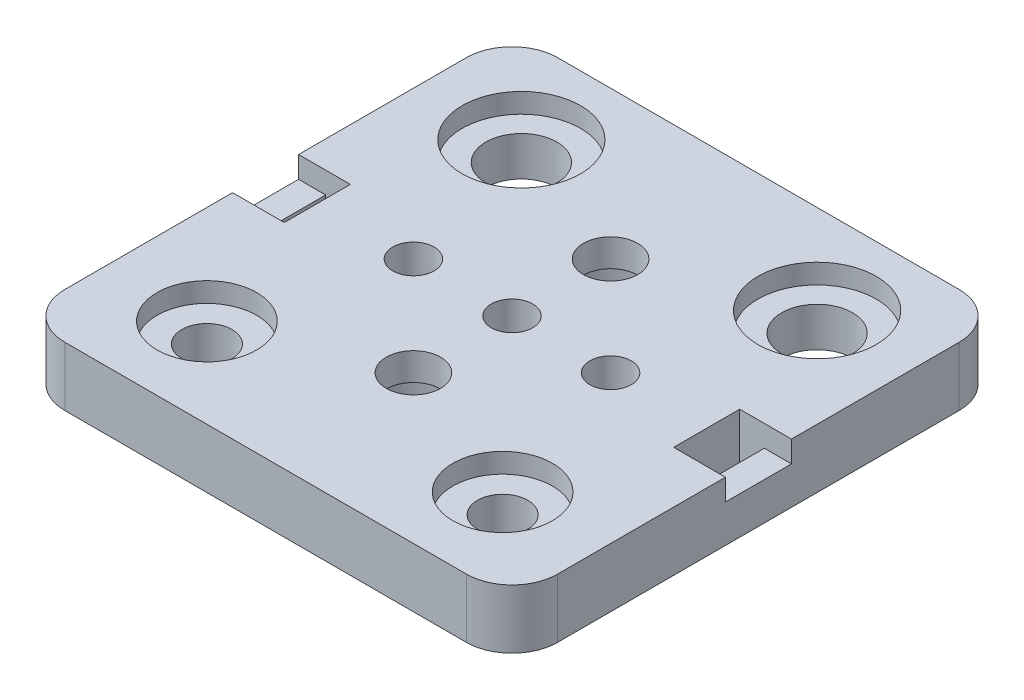
ISO-10303-21;
HEADER;
FILE_DESCRIPTION(('STEP AP214'),'2;1');
FILE_NAME('part.step','',(''),(''),'','','');
FILE_SCHEMA(('AUTOMOTIVE_DESIGN { 1 0 10303 214 1 1 1 1 }'));
ENDSEC;
DATA;
#1=APPLICATION_CONTEXT('core data for automotive mechanical design processes');
#2=APPLICATION_PROTOCOL_DEFINITION('international standard','automotive_design',2000,#1);
#3=PRODUCT_CONTEXT('',#1,'mechanical');
#4=PRODUCT('Part','Part','',(#3));
#5=PRODUCT_RELATED_PRODUCT_CATEGORY('part','',(#4));
#6=PRODUCT_DEFINITION_FORMATION('','',#4);
#7=PRODUCT_DEFINITION_CONTEXT('part definition',#1,'design');
#8=PRODUCT_DEFINITION('design','',#6,#7);
#9=PRODUCT_DEFINITION_SHAPE('','',#8);
#10=(LENGTH_UNIT() NAMED_UNIT(*) SI_UNIT(.MILLI.,.METRE.));
#11=(NAMED_UNIT(*) PLANE_ANGLE_UNIT() SI_UNIT($,.RADIAN.));
#12=(NAMED_UNIT(*) SI_UNIT($,.STERADIAN.) SOLID_ANGLE_UNIT());
#13=UNCERTAINTY_MEASURE_WITH_UNIT(LENGTH_MEASURE(1.E-05),#10,'distance_accuracy_value','');
#14=(GEOMETRIC_REPRESENTATION_CONTEXT(3) GLOBAL_UNCERTAINTY_ASSIGNED_CONTEXT((#13)) GLOBAL_UNIT_ASSIGNED_CONTEXT((#10,
#11,#12)) REPRESENTATION_CONTEXT('',''));
#15=CARTESIAN_POINT('',(0.,0.,0.));
#16=DIRECTION('',(0.,0.,1.));
#17=DIRECTION('',(1.,0.,0.));
#18=AXIS2_PLACEMENT_3D('',#15,#16,#17);
#19=CARTESIAN_POINT('',(-15.,6.,15.95));
#20=DIRECTION('',(0.,-1.,0.));
#21=DIRECTION('',(0.,0.,-1.));
#22=AXIS2_PLACEMENT_3D('',#19,#20,#21);
#23=CYLINDRICAL_SURFACE('',#22,2.55);
#24=CARTESIAN_POINT('',(-15.,0.,15.95));
#25=DIRECTION('',(0.,1.,0.));
#26=DIRECTION('',(0.,0.,-1.));
#27=AXIS2_PLACEMENT_3D('',#24,#25,#26);
#28=CIRCLE('',#27,2.55);
#29=CARTESIAN_POINT('',(-15.,0.,13.4));
#30=VERTEX_POINT('',#29);
#31=EDGE_CURVE('E328',#30,#30,#28,.T.);
#32=ORIENTED_EDGE('',*,*,#31,.F.);
#33=EDGE_LOOP('',(#32));
#34=FACE_BOUND('',#33,.T.);
#35=CARTESIAN_POINT('',(-15.,4.,15.95));
#36=DIRECTION('',(0.,1.,0.));
#37=DIRECTION('',(0.,0.,1.));
#38=AXIS2_PLACEMENT_3D('',#35,#36,#37);
#39=CIRCLE('',#38,2.55);
#40=CARTESIAN_POINT('',(-15.,4.,18.5));
#41=VERTEX_POINT('',#40);
#42=EDGE_CURVE('E52',#41,#41,#39,.T.);
#43=ORIENTED_EDGE('',*,*,#42,.T.);
#44=EDGE_LOOP('',(#43));
#45=FACE_BOUND('',#44,.T.);
#46=ADVANCED_FACE('F48',(#34,#45),#23,.F.);
#47=CARTESIAN_POINT('',(15.,6.,15.95));
#48=DIRECTION('',(0.,-1.,0.));
#49=DIRECTION('',(0.,0.,-1.));
#50=AXIS2_PLACEMENT_3D('',#47,#48,#49);
#51=CYLINDRICAL_SURFACE('',#50,2.55);
#52=CARTESIAN_POINT('',(15.,0.,15.95));
#53=DIRECTION('',(0.,1.,0.));
#54=DIRECTION('',(0.,0.,1.));
#55=AXIS2_PLACEMENT_3D('',#52,#53,#54);
#56=CIRCLE('',#55,2.55);
#57=CARTESIAN_POINT('',(15.,0.,18.5));
#58=VERTEX_POINT('',#57);
#59=EDGE_CURVE('E331',#58,#58,#56,.T.);
#60=ORIENTED_EDGE('',*,*,#59,.F.);
#61=EDGE_LOOP('',(#60));
#62=FACE_BOUND('',#61,.T.);
#63=CARTESIAN_POINT('',(15.,4.,15.95));
#64=DIRECTION('',(0.,1.,0.));
#65=DIRECTION('',(0.,0.,1.));
#66=AXIS2_PLACEMENT_3D('',#63,#64,#65);
#67=CIRCLE('',#66,2.55);
#68=CARTESIAN_POINT('',(15.,4.,18.5));
#69=VERTEX_POINT('',#68);
#70=EDGE_CURVE('E292',#69,#69,#67,.T.);
#71=ORIENTED_EDGE('',*,*,#70,.T.);
#72=EDGE_LOOP('',(#71));
#73=FACE_BOUND('',#72,.T.);
#74=ADVANCED_FACE('F404',(#62,#73),#51,.F.);
#75=CARTESIAN_POINT('',(15.,6.,-15.95));
#76=DIRECTION('',(0.,-1.,0.));
#77=DIRECTION('',(0.,0.,-1.));
#78=AXIS2_PLACEMENT_3D('',#75,#76,#77);
#79=CYLINDRICAL_SURFACE('',#78,3.6);
#80=CARTESIAN_POINT('',(15.,0.,-15.95));
#81=DIRECTION('',(0.,1.,0.));
#82=DIRECTION('',(0.,0.,-1.));
#83=AXIS2_PLACEMENT_3D('',#80,#81,#82);
#84=CIRCLE('',#83,3.6);
#85=CARTESIAN_POINT('',(15.,0.,-19.55));
#86=VERTEX_POINT('',#85);
#87=EDGE_CURVE('E334',#86,#86,#84,.T.);
#88=ORIENTED_EDGE('',*,*,#87,.F.);
#89=EDGE_LOOP('',(#88));
#90=FACE_BOUND('',#89,.T.);
#91=CARTESIAN_POINT('',(15.,4.,-15.95));
#92=DIRECTION('',(0.,1.,0.));
#93=DIRECTION('',(0.,0.,1.));
#94=AXIS2_PLACEMENT_3D('',#91,#92,#93);
#95=CIRCLE('',#94,3.6);
#96=CARTESIAN_POINT('',(15.,4.,-12.35));
#97=VERTEX_POINT('',#96);
#98=EDGE_CURVE('E299',#97,#97,#95,.T.);
#99=ORIENTED_EDGE('',*,*,#98,.T.);
#100=EDGE_LOOP('',(#99));
#101=FACE_BOUND('',#100,.T.);
#102=ADVANCED_FACE('F459',(#90,#101),#79,.F.);
#103=CARTESIAN_POINT('',(-15.,6.,-15.95));
#104=DIRECTION('',(0.,-1.,0.));
#105=DIRECTION('',(0.,0.,-1.));
#106=AXIS2_PLACEMENT_3D('',#103,#104,#105);
#107=CYLINDRICAL_SURFACE('',#106,3.6);
#108=CARTESIAN_POINT('',(-15.,0.,-15.95));
#109=DIRECTION('',(0.,1.,0.));
#110=DIRECTION('',(0.,0.,1.));
#111=AXIS2_PLACEMENT_3D('',#108,#109,#110);
#112=CIRCLE('',#111,3.6);
#113=CARTESIAN_POINT('',(-15.,0.,-12.35));
#114=VERTEX_POINT('',#113);
#115=EDGE_CURVE('E337',#114,#114,#112,.T.);
#116=ORIENTED_EDGE('',*,*,#115,.F.);
#117=EDGE_LOOP('',(#116));
#118=FACE_BOUND('',#117,.T.);
#119=CARTESIAN_POINT('',(-15.,4.,-15.95));
#120=DIRECTION('',(0.,1.,0.));
#121=DIRECTION('',(0.,0.,1.));
#122=AXIS2_PLACEMENT_3D('',#119,#120,#121);
#123=CIRCLE('',#122,3.6);
#124=CARTESIAN_POINT('',(-15.,4.,-12.35));
#125=VERTEX_POINT('',#124);
#126=EDGE_CURVE('E306',#125,#125,#123,.T.);
#127=ORIENTED_EDGE('',*,*,#126,.T.);
#128=EDGE_LOOP('',(#127));
#129=FACE_BOUND('',#128,.T.);
#130=ADVANCED_FACE('F423',(#118,#129),#107,.F.);
#131=CARTESIAN_POINT('',(-20.365,6.,-20.365));
#132=DIRECTION('',(0.,1.,0.));
#133=DIRECTION('',(0.,0.,1.));
#134=AXIS2_PLACEMENT_3D('',#131,#132,#133);
#135=PLANE('',#134);
#136=CARTESIAN_POINT('',(0.,6.,-10.));
#137=DIRECTION('',(0.,-1.,0.));
#138=DIRECTION('',(0.,0.,-1.));
#139=AXIS2_PLACEMENT_3D('',#136,#137,#138);
#140=CIRCLE('',#139,2.75);
#141=CARTESIAN_POINT('',(0.,6.,-12.75));
#142=VERTEX_POINT('',#141);
#143=EDGE_CURVE('E801',#142,#142,#140,.T.);
#144=ORIENTED_EDGE('',*,*,#143,.T.);
#145=EDGE_LOOP('',(#144));
#146=FACE_BOUND('',#145,.T.);
#147=CARTESIAN_POINT('',(0.,6.,10.));
#148=DIRECTION('',(0.,-1.,0.));
#149=DIRECTION('',(0.,0.,-1.));
#150=AXIS2_PLACEMENT_3D('',#147,#148,#149);
#151=CIRCLE('',#150,2.75);
#152=CARTESIAN_POINT('',(0.,6.,7.25));
#153=VERTEX_POINT('',#152);
#154=EDGE_CURVE('E212',#153,#153,#151,.T.);
#155=ORIENTED_EDGE('',*,*,#154,.T.);
#156=EDGE_LOOP('',(#155));
#157=FACE_BOUND('',#156,.T.);
#158=DIRECTION('',(-1.,0.,0.));
#159=VECTOR('',#158,1.);
#160=CARTESIAN_POINT('',(25.,6.,-3.35));
#161=LINE('',#160,#159);
#162=CARTESIAN_POINT('',(25.,6.,-3.35));
#163=VERTEX_POINT('',#162);
#164=CARTESIAN_POINT('',(19.75,6.,-3.35));
#165=VERTEX_POINT('',#164);
#166=EDGE_CURVE('E194',#163,#165,#161,.T.);
#167=ORIENTED_EDGE('',*,*,#166,.F.);
#168=DIRECTION('',(0.,0.,-1.));
#169=VECTOR('',#168,1.);
#170=CARTESIAN_POINT('',(25.,6.,20.365));
#171=LINE('',#170,#169);
#172=CARTESIAN_POINT('',(25.,6.,-20.365));
#173=VERTEX_POINT('',#172);
#174=EDGE_CURVE('E355',#163,#173,#171,.T.);
#175=ORIENTED_EDGE('',*,*,#174,.T.);
#176=CARTESIAN_POINT('',(20.365,6.,-20.365));
#177=DIRECTION('',(0.,1.,0.));
#178=DIRECTION('',(0.,0.,1.));
#179=AXIS2_PLACEMENT_3D('',#176,#177,#178);
#180=CIRCLE('',#179,4.635);
#181=CARTESIAN_POINT('',(20.365,6.,-25.));
#182=VERTEX_POINT('',#181);
#183=EDGE_CURVE('E359',#173,#182,#180,.T.);
#184=ORIENTED_EDGE('',*,*,#183,.T.);
#185=DIRECTION('',(-1.,0.,0.));
#186=VECTOR('',#185,1.);
#187=CARTESIAN_POINT('',(20.365,6.,-25.));
#188=LINE('',#187,#186);
#189=CARTESIAN_POINT('',(-20.365,6.,-25.));
#190=VERTEX_POINT('',#189);
#191=EDGE_CURVE('E361',#182,#190,#188,.T.);
#192=ORIENTED_EDGE('',*,*,#191,.T.);
#193=CARTESIAN_POINT('',(-20.365,6.,-20.365));
#194=DIRECTION('',(0.,1.,0.));
#195=DIRECTION('',(0.,0.,1.));
#196=AXIS2_PLACEMENT_3D('',#193,#194,#195);
#197=CIRCLE('',#196,4.635);
#198=CARTESIAN_POINT('',(-25.,6.,-20.365));
#199=VERTEX_POINT('',#198);
#200=EDGE_CURVE('E341',#190,#199,#197,.T.);
#201=ORIENTED_EDGE('',*,*,#200,.T.);
#202=DIRECTION('',(0.,0.,1.));
#203=VECTOR('',#202,1.);
#204=CARTESIAN_POINT('',(-25.,6.,20.365));
#205=LINE('',#204,#203);
#206=CARTESIAN_POINT('',(-25.,6.,-3.35));
#207=VERTEX_POINT('',#206);
#208=EDGE_CURVE('E346',#199,#207,#205,.T.);
#209=ORIENTED_EDGE('',*,*,#208,.T.);
#210=DIRECTION('',(-1.,0.,0.));
#211=VECTOR('',#210,1.);
#212=CARTESIAN_POINT('',(-25.,6.,-3.35));
#213=LINE('',#212,#211);
#214=CARTESIAN_POINT('',(-19.75,6.,-3.35));
#215=VERTEX_POINT('',#214);
#216=EDGE_CURVE('E263',#215,#207,#213,.T.);
#217=ORIENTED_EDGE('',*,*,#216,.F.);
#218=DIRECTION('',(0.,0.,-1.));
#219=VECTOR('',#218,1.);
#220=CARTESIAN_POINT('',(-19.75,6.,-3.35));
#221=LINE('',#220,#219);
#222=CARTESIAN_POINT('',(-19.75,6.,3.35));
#223=VERTEX_POINT('',#222);
#224=EDGE_CURVE('E271',#223,#215,#221,.T.);
#225=ORIENTED_EDGE('',*,*,#224,.F.);
#226=DIRECTION('',(1.,0.,0.));
#227=VECTOR('',#226,1.);
#228=CARTESIAN_POINT('',(-25.,6.,3.35));
#229=LINE('',#228,#227);
#230=CARTESIAN_POINT('',(-25.,6.,3.35));
#231=VERTEX_POINT('',#230);
#232=EDGE_CURVE('E254',#231,#223,#229,.T.);
#233=ORIENTED_EDGE('',*,*,#232,.F.);
#234=CARTESIAN_POINT('',(-25.,6.,20.365));
#235=VERTEX_POINT('',#234);
#236=EDGE_CURVE('E344',#231,#235,#205,.T.);
#237=ORIENTED_EDGE('',*,*,#236,.T.);
#238=CARTESIAN_POINT('',(-20.365,6.,20.365));
#239=DIRECTION('',(0.,1.,0.));
#240=DIRECTION('',(0.,0.,-1.));
#241=AXIS2_PLACEMENT_3D('',#238,#239,#240);
#242=CIRCLE('',#241,4.635);
#243=CARTESIAN_POINT('',(-20.365,6.,25.));
#244=VERTEX_POINT('',#243);
#245=EDGE_CURVE('E349',#235,#244,#242,.T.);
#246=ORIENTED_EDGE('',*,*,#245,.T.);
#247=DIRECTION('',(1.,0.,0.));
#248=VECTOR('',#247,1.);
#249=CARTESIAN_POINT('',(20.365,6.,25.));
#250=LINE('',#249,#248);
#251=CARTESIAN_POINT('',(20.365,6.,25.));
#252=VERTEX_POINT('',#251);
#253=EDGE_CURVE('E351',#244,#252,#250,.T.);
#254=ORIENTED_EDGE('',*,*,#253,.T.);
#255=CARTESIAN_POINT('',(20.365,6.,20.365));
#256=DIRECTION('',(0.,1.,0.));
#257=DIRECTION('',(0.,0.,1.));
#258=AXIS2_PLACEMENT_3D('',#255,#256,#257);
#259=CIRCLE('',#258,4.635);
#260=CARTESIAN_POINT('',(25.,6.,20.365));
#261=VERTEX_POINT('',#260);
#262=EDGE_CURVE('E353',#252,#261,#259,.T.);
#263=ORIENTED_EDGE('',*,*,#262,.T.);
#264=CARTESIAN_POINT('',(25.,6.,3.35));
#265=VERTEX_POINT('',#264);
#266=EDGE_CURVE('E356',#261,#265,#171,.T.);
#267=ORIENTED_EDGE('',*,*,#266,.T.);
#268=DIRECTION('',(1.,0.,0.));
#269=VECTOR('',#268,1.);
#270=CARTESIAN_POINT('',(25.,6.,3.35));
#271=LINE('',#270,#269);
#272=CARTESIAN_POINT('',(19.75,6.,3.35));
#273=VERTEX_POINT('',#272);
#274=EDGE_CURVE('E244',#273,#265,#271,.T.);
#275=ORIENTED_EDGE('',*,*,#274,.F.);
#276=DIRECTION('',(0.,0.,1.));
#277=VECTOR('',#276,1.);
#278=CARTESIAN_POINT('',(19.75,6.,-3.35));
#279=LINE('',#278,#277);
#280=EDGE_CURVE('E249',#165,#273,#279,.T.);
#281=ORIENTED_EDGE('',*,*,#280,.F.);
#282=EDGE_LOOP('',(#167,#175,#184,#192,#201,#209,#217,#225,#233,#237,#246,#254,#263,#267,#275,#281));
#283=FACE_BOUND('',#282,.T.);
#284=CARTESIAN_POINT('',(-15.,6.,15.95));
#285=DIRECTION('',(0.,1.,0.));
#286=DIRECTION('',(0.,0.,1.));
#287=AXIS2_PLACEMENT_3D('',#284,#285,#286);
#288=CIRCLE('',#287,5.05);
#289=CARTESIAN_POINT('',(-15.,6.,21.));
#290=VERTEX_POINT('',#289);
#291=EDGE_CURVE('E278',#290,#290,#288,.T.);
#292=ORIENTED_EDGE('',*,*,#291,.F.);
#293=EDGE_LOOP('',(#292));
#294=FACE_BOUND('',#293,.T.);
#295=CARTESIAN_POINT('',(15.,6.,15.95));
#296=DIRECTION('',(0.,1.,0.));
#297=DIRECTION('',(0.,0.,1.));
#298=AXIS2_PLACEMENT_3D('',#295,#296,#297);
#299=CIRCLE('',#298,5.05);
#300=CARTESIAN_POINT('',(15.,6.,21.));
#301=VERTEX_POINT('',#300);
#302=EDGE_CURVE('E293',#301,#301,#299,.T.);
#303=ORIENTED_EDGE('',*,*,#302,.F.);
#304=EDGE_LOOP('',(#303));
#305=FACE_BOUND('',#304,.T.);
#306=CARTESIAN_POINT('',(15.,6.,-15.95));
#307=DIRECTION('',(0.,1.,0.));
#308=DIRECTION('',(0.,0.,1.));
#309=AXIS2_PLACEMENT_3D('',#306,#307,#308);
#310=CIRCLE('',#309,6.00000000000001);
#311=CARTESIAN_POINT('',(15.,6.,-9.94999999999998));
#312=VERTEX_POINT('',#311);
#313=EDGE_CURVE('E300',#312,#312,#310,.T.);
#314=ORIENTED_EDGE('',*,*,#313,.F.);
#315=EDGE_LOOP('',(#314));
#316=FACE_BOUND('',#315,.T.);
#317=CARTESIAN_POINT('',(-15.,6.,-15.95));
#318=DIRECTION('',(0.,1.,0.));
#319=DIRECTION('',(0.,0.,1.));
#320=AXIS2_PLACEMENT_3D('',#317,#318,#319);
#321=CIRCLE('',#320,6.);
#322=CARTESIAN_POINT('',(-15.,6.,-9.94999999999998));
#323=VERTEX_POINT('',#322);
#324=EDGE_CURVE('E307',#323,#323,#321,.T.);
#325=ORIENTED_EDGE('',*,*,#324,.F.);
#326=EDGE_LOOP('',(#325));
#327=FACE_BOUND('',#326,.T.);
#328=CARTESIAN_POINT('',(-10.,6.,0.));
#329=DIRECTION('',(0.,1.,0.));
#330=DIRECTION('',(0.,0.,1.));
#331=AXIS2_PLACEMENT_3D('',#328,#329,#330);
#332=CIRCLE('',#331,2.1);
#333=CARTESIAN_POINT('',(-10.,6.,2.1));
#334=VERTEX_POINT('',#333);
#335=EDGE_CURVE('E310',#334,#334,#332,.T.);
#336=ORIENTED_EDGE('',*,*,#335,.F.);
#337=EDGE_LOOP('',(#336));
#338=FACE_BOUND('',#337,.T.);
#339=CARTESIAN_POINT('',(0.,6.,0.));
#340=DIRECTION('',(0.,1.,0.));
#341=DIRECTION('',(0.,0.,1.));
#342=AXIS2_PLACEMENT_3D('',#339,#340,#341);
#343=CIRCLE('',#342,2.1);
#344=CARTESIAN_POINT('',(0.,6.,2.1));
#345=VERTEX_POINT('',#344);
#346=EDGE_CURVE('E316',#345,#345,#343,.T.);
#347=ORIENTED_EDGE('',*,*,#346,.F.);
#348=EDGE_LOOP('',(#347));
#349=FACE_BOUND('',#348,.T.);
#350=CARTESIAN_POINT('',(10.,6.,0.));
#351=DIRECTION('',(0.,1.,0.));
#352=DIRECTION('',(0.,0.,1.));
#353=AXIS2_PLACEMENT_3D('',#350,#351,#352);
#354=CIRCLE('',#353,2.1);
#355=CARTESIAN_POINT('',(10.,6.,2.1));
#356=VERTEX_POINT('',#355);
#357=EDGE_CURVE('E322',#356,#356,#354,.T.);
#358=ORIENTED_EDGE('',*,*,#357,.F.);
#359=EDGE_LOOP('',(#358));
#360=FACE_BOUND('',#359,.T.);
#361=ADVANCED_FACE('F420',(#146,#157,#283,#294,#305,#316,#327,#338,#349,#360),#135,.T.);
#362=CARTESIAN_POINT('',(-20.365,0.,-20.365));
#363=DIRECTION('',(0.,1.,0.));
#364=DIRECTION('',(0.,0.,1.));
#365=AXIS2_PLACEMENT_3D('',#362,#363,#364);
#366=PLANE('',#365);
#367=CARTESIAN_POINT('',(0.,0.,-10.));
#368=DIRECTION('',(0.,-1.,0.));
#369=DIRECTION('',(0.,0.,-1.));
#370=AXIS2_PLACEMENT_3D('',#367,#368,#369);
#371=CIRCLE('',#370,5.);
#372=CARTESIAN_POINT('',(0.,0.,-15.));
#373=VERTEX_POINT('',#372);
#374=EDGE_CURVE('E794',#373,#373,#371,.T.);
#375=ORIENTED_EDGE('',*,*,#374,.F.);
#376=EDGE_LOOP('',(#375));
#377=FACE_BOUND('',#376,.T.);
#378=CARTESIAN_POINT('',(0.,0.,10.));
#379=DIRECTION('',(0.,-1.,0.));
#380=DIRECTION('',(0.,0.,-1.));
#381=AXIS2_PLACEMENT_3D('',#378,#379,#380);
#382=CIRCLE('',#381,5.);
#383=CARTESIAN_POINT('',(0.,0.,5.));
#384=VERTEX_POINT('',#383);
#385=EDGE_CURVE('E804',#384,#384,#382,.T.);
#386=ORIENTED_EDGE('',*,*,#385,.F.);
#387=EDGE_LOOP('',(#386));
#388=FACE_BOUND('',#387,.T.);
#389=DIRECTION('',(0.,0.,-1.));
#390=VECTOR('',#389,1.);
#391=CARTESIAN_POINT('',(22.25,0.,-3.35));
#392=LINE('',#391,#390);
#393=CARTESIAN_POINT('',(22.25,0.,3.35));
#394=VERTEX_POINT('',#393);
#395=CARTESIAN_POINT('',(22.25,0.,-3.35));
#396=VERTEX_POINT('',#395);
#397=EDGE_CURVE('E208',#394,#396,#392,.T.);
#398=ORIENTED_EDGE('',*,*,#397,.T.);
#399=DIRECTION('',(-1.,0.,0.));
#400=VECTOR('',#399,1.);
#401=CARTESIAN_POINT('',(19.75,0.,-3.35));
#402=LINE('',#401,#400);
#403=CARTESIAN_POINT('',(19.75,0.,-3.35));
#404=VERTEX_POINT('',#403);
#405=EDGE_CURVE('E191',#396,#404,#402,.T.);
#406=ORIENTED_EDGE('',*,*,#405,.T.);
#407=DIRECTION('',(0.,0.,1.));
#408=VECTOR('',#407,1.);
#409=CARTESIAN_POINT('',(19.75,0.,-3.35));
#410=LINE('',#409,#408);
#411=CARTESIAN_POINT('',(19.75,0.,3.35));
#412=VERTEX_POINT('',#411);
#413=EDGE_CURVE('E199',#404,#412,#410,.T.);
#414=ORIENTED_EDGE('',*,*,#413,.T.);
#415=DIRECTION('',(1.,0.,0.));
#416=VECTOR('',#415,1.);
#417=CARTESIAN_POINT('',(19.75,0.,3.35));
#418=LINE('',#417,#416);
#419=EDGE_CURVE('E203',#412,#394,#418,.T.);
#420=ORIENTED_EDGE('',*,*,#419,.T.);
#421=EDGE_LOOP('',(#398,#406,#414,#420));
#422=FACE_BOUND('',#421,.T.);
#423=DIRECTION('',(1.,0.,0.));
#424=VECTOR('',#423,1.);
#425=CARTESIAN_POINT('',(-19.75,0.,3.35));
#426=LINE('',#425,#424);
#427=CARTESIAN_POINT('',(-22.25,0.,3.35));
#428=VERTEX_POINT('',#427);
#429=CARTESIAN_POINT('',(-19.75,0.,3.35));
#430=VERTEX_POINT('',#429);
#431=EDGE_CURVE('E231',#428,#430,#426,.T.);
#432=ORIENTED_EDGE('',*,*,#431,.T.);
#433=DIRECTION('',(0.,0.,-1.));
#434=VECTOR('',#433,1.);
#435=CARTESIAN_POINT('',(-19.75,0.,-3.35));
#436=LINE('',#435,#434);
#437=CARTESIAN_POINT('',(-19.75,0.,-3.35));
#438=VERTEX_POINT('',#437);
#439=EDGE_CURVE('E224',#430,#438,#436,.T.);
#440=ORIENTED_EDGE('',*,*,#439,.T.);
#441=DIRECTION('',(-1.,0.,0.));
#442=VECTOR('',#441,1.);
#443=CARTESIAN_POINT('',(-19.75,0.,-3.35));
#444=LINE('',#443,#442);
#445=CARTESIAN_POINT('',(-22.25,0.,-3.35));
#446=VERTEX_POINT('',#445);
#447=EDGE_CURVE('E227',#438,#446,#444,.T.);
#448=ORIENTED_EDGE('',*,*,#447,.T.);
#449=DIRECTION('',(0.,0.,1.));
#450=VECTOR('',#449,1.);
#451=CARTESIAN_POINT('',(-22.25,0.,-3.35));
#452=LINE('',#451,#450);
#453=EDGE_CURVE('E73',#446,#428,#452,.T.);
#454=ORIENTED_EDGE('',*,*,#453,.T.);
#455=EDGE_LOOP('',(#432,#440,#448,#454));
#456=FACE_BOUND('',#455,.T.);
#457=CARTESIAN_POINT('',(-10.,0.,0.));
#458=DIRECTION('',(0.,1.,0.));
#459=DIRECTION('',(0.,0.,1.));
#460=AXIS2_PLACEMENT_3D('',#457,#458,#459);
#461=CIRCLE('',#460,2.1);
#462=CARTESIAN_POINT('',(-10.,0.,2.1));
#463=VERTEX_POINT('',#462);
#464=EDGE_CURVE('E313',#463,#463,#461,.T.);
#465=ORIENTED_EDGE('',*,*,#464,.T.);
#466=EDGE_LOOP('',(#465));
#467=FACE_BOUND('',#466,.T.);
#468=CARTESIAN_POINT('',(0.,0.,0.));
#469=DIRECTION('',(0.,1.,0.));
#470=DIRECTION('',(0.,0.,1.));
#471=AXIS2_PLACEMENT_3D('',#468,#469,#470);
#472=CIRCLE('',#471,2.1);
#473=CARTESIAN_POINT('',(0.,0.,2.1));
#474=VERTEX_POINT('',#473);
#475=EDGE_CURVE('E319',#474,#474,#472,.T.);
#476=ORIENTED_EDGE('',*,*,#475,.T.);
#477=EDGE_LOOP('',(#476));
#478=FACE_BOUND('',#477,.T.);
#479=CARTESIAN_POINT('',(10.,0.,0.));
#480=DIRECTION('',(0.,1.,0.));
#481=DIRECTION('',(0.,0.,1.));
#482=AXIS2_PLACEMENT_3D('',#479,#480,#481);
#483=CIRCLE('',#482,2.1);
#484=CARTESIAN_POINT('',(10.,0.,2.1));
#485=VERTEX_POINT('',#484);
#486=EDGE_CURVE('E325',#485,#485,#483,.T.);
#487=ORIENTED_EDGE('',*,*,#486,.T.);
#488=EDGE_LOOP('',(#487));
#489=FACE_BOUND('',#488,.T.);
#490=ORIENTED_EDGE('',*,*,#59,.T.);
#491=EDGE_LOOP('',(#490));
#492=FACE_BOUND('',#491,.T.);
#493=ORIENTED_EDGE('',*,*,#115,.T.);
#494=EDGE_LOOP('',(#493));
#495=FACE_BOUND('',#494,.T.);
#496=CARTESIAN_POINT('',(-20.365,0.,-20.365));
#497=DIRECTION('',(0.,1.,0.));
#498=DIRECTION('',(0.,0.,1.));
#499=AXIS2_PLACEMENT_3D('',#496,#497,#498);
#500=CIRCLE('',#499,4.635);
#501=CARTESIAN_POINT('',(-20.365,0.,-25.));
#502=VERTEX_POINT('',#501);
#503=CARTESIAN_POINT('',(-25.,0.,-20.365));
#504=VERTEX_POINT('',#503);
#505=EDGE_CURVE('E340',#502,#504,#500,.T.);
#506=ORIENTED_EDGE('',*,*,#505,.F.);
#507=DIRECTION('',(-1.,0.,0.));
#508=VECTOR('',#507,1.);
#509=CARTESIAN_POINT('',(20.365,0.,-25.));
#510=LINE('',#509,#508);
#511=CARTESIAN_POINT('',(20.365,0.,-25.));
#512=VERTEX_POINT('',#511);
#513=EDGE_CURVE('E345',#512,#502,#510,.T.);
#514=ORIENTED_EDGE('',*,*,#513,.F.);
#515=CARTESIAN_POINT('',(20.365,0.,-20.365));
#516=DIRECTION('',(0.,1.,0.));
#517=DIRECTION('',(0.,0.,1.));
#518=AXIS2_PLACEMENT_3D('',#515,#516,#517);
#519=CIRCLE('',#518,4.635);
#520=CARTESIAN_POINT('',(25.,0.,-20.365));
#521=VERTEX_POINT('',#520);
#522=EDGE_CURVE('E376',#521,#512,#519,.T.);
#523=ORIENTED_EDGE('',*,*,#522,.F.);
#524=DIRECTION('',(0.,0.,-1.));
#525=VECTOR('',#524,1.);
#526=CARTESIAN_POINT('',(25.,0.,20.365));
#527=LINE('',#526,#525);
#528=CARTESIAN_POINT('',(25.,0.,20.365));
#529=VERTEX_POINT('',#528);
#530=EDGE_CURVE('E374',#529,#521,#527,.T.);
#531=ORIENTED_EDGE('',*,*,#530,.F.);
#532=CARTESIAN_POINT('',(20.365,0.,20.365));
#533=DIRECTION('',(0.,1.,0.));
#534=DIRECTION('',(0.,0.,1.));
#535=AXIS2_PLACEMENT_3D('',#532,#533,#534);
#536=CIRCLE('',#535,4.635);
#537=CARTESIAN_POINT('',(20.365,0.,25.));
#538=VERTEX_POINT('',#537);
#539=EDGE_CURVE('E372',#538,#529,#536,.T.);
#540=ORIENTED_EDGE('',*,*,#539,.F.);
#541=DIRECTION('',(1.,0.,0.));
#542=VECTOR('',#541,1.);
#543=CARTESIAN_POINT('',(20.365,0.,25.));
#544=LINE('',#543,#542);
#545=CARTESIAN_POINT('',(-20.365,0.,25.));
#546=VERTEX_POINT('',#545);
#547=EDGE_CURVE('E370',#546,#538,#544,.T.);
#548=ORIENTED_EDGE('',*,*,#547,.F.);
#549=CARTESIAN_POINT('',(-20.365,0.,20.365));
#550=DIRECTION('',(0.,1.,0.));
#551=DIRECTION('',(0.,0.,-1.));
#552=AXIS2_PLACEMENT_3D('',#549,#550,#551);
#553=CIRCLE('',#552,4.635);
#554=CARTESIAN_POINT('',(-25.,0.,20.365));
#555=VERTEX_POINT('',#554);
#556=EDGE_CURVE('E368',#555,#546,#553,.T.);
#557=ORIENTED_EDGE('',*,*,#556,.F.);
#558=DIRECTION('',(0.,0.,1.));
#559=VECTOR('',#558,1.);
#560=CARTESIAN_POINT('',(-25.,0.,20.365));
#561=LINE('',#560,#559);
#562=EDGE_CURVE('E366',#504,#555,#561,.T.);
#563=ORIENTED_EDGE('',*,*,#562,.F.);
#564=EDGE_LOOP('',(#506,#514,#523,#531,#540,#548,#557,#563));
#565=FACE_BOUND('',#564,.T.);
#566=ORIENTED_EDGE('',*,*,#87,.T.);
#567=EDGE_LOOP('',(#566));
#568=FACE_BOUND('',#567,.T.);
#569=ORIENTED_EDGE('',*,*,#31,.T.);
#570=EDGE_LOOP('',(#569));
#571=FACE_BOUND('',#570,.T.);
#572=ADVANCED_FACE('F205',(#377,#388,#422,#456,#467,#478,#489,#492,#495,#565,#568,#571),#366,.F.);
#573=CARTESIAN_POINT('',(-20.365,6.,-20.365));
#574=DIRECTION('',(0.,-1.,0.));
#575=DIRECTION('',(0.,0.,-1.));
#576=AXIS2_PLACEMENT_3D('',#573,#574,#575);
#577=CYLINDRICAL_SURFACE('',#576,4.635);
#578=ORIENTED_EDGE('',*,*,#505,.T.);
#579=DIRECTION('',(0.,-1.,0.));
#580=VECTOR('',#579,1.);
#581=CARTESIAN_POINT('',(-25.,6.,-20.365));
#582=LINE('',#581,#580);
#583=EDGE_CURVE('E13',#199,#504,#582,.T.);
#584=ORIENTED_EDGE('',*,*,#583,.F.);
#585=ORIENTED_EDGE('',*,*,#200,.F.);
#586=DIRECTION('',(0.,-1.,0.));
#587=VECTOR('',#586,1.);
#588=CARTESIAN_POINT('',(-20.365,6.,-25.));
#589=LINE('',#588,#587);
#590=EDGE_CURVE('E363',#190,#502,#589,.T.);
#591=ORIENTED_EDGE('',*,*,#590,.T.);
#592=EDGE_LOOP('',(#578,#584,#585,#591));
#593=FACE_BOUND('',#592,.T.);
#594=ADVANCED_FACE('F50',(#593),#577,.T.);
#595=CARTESIAN_POINT('',(-25.,6.,20.365));
#596=DIRECTION('',(1.,0.,0.));
#597=DIRECTION('',(0.,0.,-1.));
#598=AXIS2_PLACEMENT_3D('',#595,#596,#597);
#599=PLANE('',#598);
#600=DIRECTION('',(0.,0.,1.));
#601=VECTOR('',#600,1.);
#602=CARTESIAN_POINT('',(-25.,3.82,-3.35));
#603=LINE('',#602,#601);
#604=CARTESIAN_POINT('',(-25.,3.82,-3.35));
#605=VERTEX_POINT('',#604);
#606=CARTESIAN_POINT('',(-25.,3.82,3.35));
#607=VERTEX_POINT('',#606);
#608=EDGE_CURVE('E259',#605,#607,#603,.T.);
#609=ORIENTED_EDGE('',*,*,#608,.F.);
#610=DIRECTION('',(0.,1.,0.));
#611=VECTOR('',#610,1.);
#612=CARTESIAN_POINT('',(-25.,3.82,-3.35));
#613=LINE('',#612,#611);
#614=EDGE_CURVE('E275',#605,#207,#613,.T.);
#615=ORIENTED_EDGE('',*,*,#614,.T.);
#616=ORIENTED_EDGE('',*,*,#208,.F.);
#617=ORIENTED_EDGE('',*,*,#583,.T.);
#618=ORIENTED_EDGE('',*,*,#562,.T.);
#619=DIRECTION('',(0.,-1.,0.));
#620=VECTOR('',#619,1.);
#621=CARTESIAN_POINT('',(-25.,6.,20.365));
#622=LINE('',#621,#620);
#623=EDGE_CURVE('E57',#235,#555,#622,.T.);
#624=ORIENTED_EDGE('',*,*,#623,.F.);
#625=ORIENTED_EDGE('',*,*,#236,.F.);
#626=DIRECTION('',(0.,1.,0.));
#627=VECTOR('',#626,1.);
#628=CARTESIAN_POINT('',(-25.,3.82,3.35));
#629=LINE('',#628,#627);
#630=EDGE_CURVE('E268',#607,#231,#629,.T.);
#631=ORIENTED_EDGE('',*,*,#630,.F.);
#632=EDGE_LOOP('',(#609,#615,#616,#617,#618,#624,#625,#631));
#633=FACE_BOUND('',#632,.T.);
#634=ADVANCED_FACE('F491',(#633),#599,.F.);
#635=CARTESIAN_POINT('',(-20.365,6.,20.365));
#636=DIRECTION('',(0.,-1.,0.));
#637=DIRECTION('',(0.,0.,-1.));
#638=AXIS2_PLACEMENT_3D('',#635,#636,#637);
#639=CYLINDRICAL_SURFACE('',#638,4.635);
#640=ORIENTED_EDGE('',*,*,#556,.T.);
#641=DIRECTION('',(0.,-1.,0.));
#642=VECTOR('',#641,1.);
#643=CARTESIAN_POINT('',(-20.365,6.,25.));
#644=LINE('',#643,#642);
#645=EDGE_CURVE('E393',#244,#546,#644,.T.);
#646=ORIENTED_EDGE('',*,*,#645,.F.);
#647=ORIENTED_EDGE('',*,*,#245,.F.);
#648=ORIENTED_EDGE('',*,*,#623,.T.);
#649=EDGE_LOOP('',(#640,#646,#647,#648));
#650=FACE_BOUND('',#649,.T.);
#651=ADVANCED_FACE('F488',(#650),#639,.T.);
#652=CARTESIAN_POINT('',(20.365,6.,25.));
#653=DIRECTION('',(0.,0.,-1.));
#654=DIRECTION('',(-1.,0.,0.));
#655=AXIS2_PLACEMENT_3D('',#652,#653,#654);
#656=PLANE('',#655);
#657=ORIENTED_EDGE('',*,*,#547,.T.);
#658=DIRECTION('',(0.,-1.,0.));
#659=VECTOR('',#658,1.);
#660=CARTESIAN_POINT('',(20.365,6.,25.));
#661=LINE('',#660,#659);
#662=EDGE_CURVE('E390',#252,#538,#661,.T.);
#663=ORIENTED_EDGE('',*,*,#662,.F.);
#664=ORIENTED_EDGE('',*,*,#253,.F.);
#665=ORIENTED_EDGE('',*,*,#645,.T.);
#666=EDGE_LOOP('',(#657,#663,#664,#665));
#667=FACE_BOUND('',#666,.T.);
#668=ADVANCED_FACE('F484',(#667),#656,.F.);
#669=CARTESIAN_POINT('',(20.365,6.,20.365));
#670=DIRECTION('',(0.,-1.,0.));
#671=DIRECTION('',(0.,0.,-1.));
#672=AXIS2_PLACEMENT_3D('',#669,#670,#671);
#673=CYLINDRICAL_SURFACE('',#672,4.635);
#674=ORIENTED_EDGE('',*,*,#539,.T.);
#675=DIRECTION('',(0.,-1.,0.));
#676=VECTOR('',#675,1.);
#677=CARTESIAN_POINT('',(25.,6.,20.365));
#678=LINE('',#677,#676);
#679=EDGE_CURVE('E387',#261,#529,#678,.T.);
#680=ORIENTED_EDGE('',*,*,#679,.F.);
#681=ORIENTED_EDGE('',*,*,#262,.F.);
#682=ORIENTED_EDGE('',*,*,#662,.T.);
#683=EDGE_LOOP('',(#674,#680,#681,#682));
#684=FACE_BOUND('',#683,.T.);
#685=ADVANCED_FACE('F480',(#684),#673,.T.);
#686=CARTESIAN_POINT('',(25.,6.,20.365));
#687=DIRECTION('',(-1.,0.,0.));
#688=DIRECTION('',(0.,0.,1.));
#689=AXIS2_PLACEMENT_3D('',#686,#687,#688);
#690=PLANE('',#689);
#691=ORIENTED_EDGE('',*,*,#174,.F.);
#692=DIRECTION('',(0.,1.,0.));
#693=VECTOR('',#692,1.);
#694=CARTESIAN_POINT('',(25.,3.82,-3.35));
#695=LINE('',#694,#693);
#696=CARTESIAN_POINT('',(25.,3.82,-3.35));
#697=VERTEX_POINT('',#696);
#698=EDGE_CURVE('E252',#697,#163,#695,.T.);
#699=ORIENTED_EDGE('',*,*,#698,.F.);
#700=DIRECTION('',(0.,0.,-1.));
#701=VECTOR('',#700,1.);
#702=CARTESIAN_POINT('',(25.,3.82,-3.35));
#703=LINE('',#702,#701);
#704=CARTESIAN_POINT('',(25.,3.82,3.35));
#705=VERTEX_POINT('',#704);
#706=EDGE_CURVE('E196',#705,#697,#703,.T.);
#707=ORIENTED_EDGE('',*,*,#706,.F.);
#708=DIRECTION('',(0.,1.,0.));
#709=VECTOR('',#708,1.);
#710=CARTESIAN_POINT('',(25.,3.82,3.35));
#711=LINE('',#710,#709);
#712=EDGE_CURVE('E255',#705,#265,#711,.T.);
#713=ORIENTED_EDGE('',*,*,#712,.T.);
#714=ORIENTED_EDGE('',*,*,#266,.F.);
#715=ORIENTED_EDGE('',*,*,#679,.T.);
#716=ORIENTED_EDGE('',*,*,#530,.T.);
#717=DIRECTION('',(0.,-1.,0.));
#718=VECTOR('',#717,1.);
#719=CARTESIAN_POINT('',(25.,6.,-20.365));
#720=LINE('',#719,#718);
#721=EDGE_CURVE('E384',#173,#521,#720,.T.);
#722=ORIENTED_EDGE('',*,*,#721,.F.);
#723=EDGE_LOOP('',(#691,#699,#707,#713,#714,#715,#716,#722));
#724=FACE_BOUND('',#723,.T.);
#725=ADVANCED_FACE('F476',(#724),#690,.F.);
#726=CARTESIAN_POINT('',(20.365,6.,-20.365));
#727=DIRECTION('',(0.,-1.,0.));
#728=DIRECTION('',(0.,0.,-1.));
#729=AXIS2_PLACEMENT_3D('',#726,#727,#728);
#730=CYLINDRICAL_SURFACE('',#729,4.635);
#731=ORIENTED_EDGE('',*,*,#522,.T.);
#732=DIRECTION('',(0.,-1.,0.));
#733=VECTOR('',#732,1.);
#734=CARTESIAN_POINT('',(20.365,6.,-25.));
#735=LINE('',#734,#733);
#736=EDGE_CURVE('E381',#182,#512,#735,.T.);
#737=ORIENTED_EDGE('',*,*,#736,.F.);
#738=ORIENTED_EDGE('',*,*,#183,.F.);
#739=ORIENTED_EDGE('',*,*,#721,.T.);
#740=EDGE_LOOP('',(#731,#737,#738,#739));
#741=FACE_BOUND('',#740,.T.);
#742=ADVANCED_FACE('F449',(#741),#730,.T.);
#743=CARTESIAN_POINT('',(20.365,6.,-25.));
#744=DIRECTION('',(0.,0.,1.));
#745=DIRECTION('',(1.,0.,0.));
#746=AXIS2_PLACEMENT_3D('',#743,#744,#745);
#747=PLANE('',#746);
#748=ORIENTED_EDGE('',*,*,#513,.T.);
#749=ORIENTED_EDGE('',*,*,#590,.F.);
#750=ORIENTED_EDGE('',*,*,#191,.F.);
#751=ORIENTED_EDGE('',*,*,#736,.T.);
#752=EDGE_LOOP('',(#748,#749,#750,#751));
#753=FACE_BOUND('',#752,.T.);
#754=ADVANCED_FACE('F439',(#753),#747,.F.);
#755=CARTESIAN_POINT('',(10.,6.,0.));
#756=DIRECTION('',(0.,1.,0.));
#757=DIRECTION('',(0.,0.,1.));
#758=AXIS2_PLACEMENT_3D('',#755,#756,#757);
#759=CYLINDRICAL_SURFACE('',#758,2.1);
#760=ORIENTED_EDGE('',*,*,#486,.F.);
#761=EDGE_LOOP('',(#760));
#762=FACE_BOUND('',#761,.T.);
#763=ORIENTED_EDGE('',*,*,#357,.T.);
#764=EDGE_LOOP('',(#763));
#765=FACE_BOUND('',#764,.T.);
#766=ADVANCED_FACE('F436',(#762,#765),#759,.F.);
#767=CARTESIAN_POINT('',(0.,6.,0.));
#768=DIRECTION('',(0.,1.,0.));
#769=DIRECTION('',(0.,0.,1.));
#770=AXIS2_PLACEMENT_3D('',#767,#768,#769);
#771=CYLINDRICAL_SURFACE('',#770,2.1);
#772=ORIENTED_EDGE('',*,*,#475,.F.);
#773=EDGE_LOOP('',(#772));
#774=FACE_BOUND('',#773,.T.);
#775=ORIENTED_EDGE('',*,*,#346,.T.);
#776=EDGE_LOOP('',(#775));
#777=FACE_BOUND('',#776,.T.);
#778=ADVANCED_FACE('F438',(#774,#777),#771,.F.);
#779=CARTESIAN_POINT('',(-10.,6.,0.));
#780=DIRECTION('',(0.,1.,0.));
#781=DIRECTION('',(0.,0.,1.));
#782=AXIS2_PLACEMENT_3D('',#779,#780,#781);
#783=CYLINDRICAL_SURFACE('',#782,2.1);
#784=ORIENTED_EDGE('',*,*,#464,.F.);
#785=EDGE_LOOP('',(#784));
#786=FACE_BOUND('',#785,.T.);
#787=ORIENTED_EDGE('',*,*,#335,.T.);
#788=EDGE_LOOP('',(#787));
#789=FACE_BOUND('',#788,.T.);
#790=ADVANCED_FACE('F446',(#786,#789),#783,.F.);
#791=CARTESIAN_POINT('',(-15.,4.,-15.95));
#792=DIRECTION('',(0.,1.,0.));
#793=DIRECTION('',(0.,0.,1.));
#794=AXIS2_PLACEMENT_3D('',#791,#792,#793);
#795=CYLINDRICAL_SURFACE('',#794,6.);
#796=CARTESIAN_POINT('',(-15.,4.,-15.95));
#797=DIRECTION('',(0.,1.,0.));
#798=DIRECTION('',(0.,0.,1.));
#799=AXIS2_PLACEMENT_3D('',#796,#797,#798);
#800=CIRCLE('',#799,6.);
#801=CARTESIAN_POINT('',(-15.,4.,-9.94999999999998));
#802=VERTEX_POINT('',#801);
#803=EDGE_CURVE('E303',#802,#802,#800,.T.);
#804=ORIENTED_EDGE('',*,*,#803,.F.);
#805=EDGE_LOOP('',(#804));
#806=FACE_BOUND('',#805,.T.);
#807=ORIENTED_EDGE('',*,*,#324,.T.);
#808=EDGE_LOOP('',(#807));
#809=FACE_BOUND('',#808,.T.);
#810=ADVANCED_FACE('F568',(#806,#809),#795,.F.);
#811=CARTESIAN_POINT('',(-15.,4.,-15.95));
#812=DIRECTION('',(0.,1.,0.));
#813=DIRECTION('',(0.,0.,1.));
#814=AXIS2_PLACEMENT_3D('',#811,#812,#813);
#815=PLANE('',#814);
#816=ORIENTED_EDGE('',*,*,#126,.F.);
#817=EDGE_LOOP('',(#816));
#818=FACE_BOUND('',#817,.T.);
#819=ORIENTED_EDGE('',*,*,#803,.T.);
#820=EDGE_LOOP('',(#819));
#821=FACE_BOUND('',#820,.T.);
#822=ADVANCED_FACE('F564',(#818,#821),#815,.T.);
#823=CARTESIAN_POINT('',(15.,4.,-15.95));
#824=DIRECTION('',(0.,1.,0.));
#825=DIRECTION('',(0.,0.,1.));
#826=AXIS2_PLACEMENT_3D('',#823,#824,#825);
#827=CYLINDRICAL_SURFACE('',#826,6.00000000000001);
#828=CARTESIAN_POINT('',(15.,4.,-15.95));
#829=DIRECTION('',(0.,1.,0.));
#830=DIRECTION('',(0.,0.,1.));
#831=AXIS2_PLACEMENT_3D('',#828,#829,#830);
#832=CIRCLE('',#831,6.00000000000001);
#833=CARTESIAN_POINT('',(15.,4.,-9.94999999999998));
#834=VERTEX_POINT('',#833);
#835=EDGE_CURVE('E296',#834,#834,#832,.T.);
#836=ORIENTED_EDGE('',*,*,#835,.F.);
#837=EDGE_LOOP('',(#836));
#838=FACE_BOUND('',#837,.T.);
#839=ORIENTED_EDGE('',*,*,#313,.T.);
#840=EDGE_LOOP('',(#839));
#841=FACE_BOUND('',#840,.T.);
#842=ADVANCED_FACE('F560',(#838,#841),#827,.F.);
#843=CARTESIAN_POINT('',(15.,4.,-15.95));
#844=DIRECTION('',(0.,1.,0.));
#845=DIRECTION('',(0.,0.,1.));
#846=AXIS2_PLACEMENT_3D('',#843,#844,#845);
#847=PLANE('',#846);
#848=ORIENTED_EDGE('',*,*,#98,.F.);
#849=EDGE_LOOP('',(#848));
#850=FACE_BOUND('',#849,.T.);
#851=ORIENTED_EDGE('',*,*,#835,.T.);
#852=EDGE_LOOP('',(#851));
#853=FACE_BOUND('',#852,.T.);
#854=ADVANCED_FACE('F416',(#850,#853),#847,.T.);
#855=CARTESIAN_POINT('',(15.,4.,15.95));
#856=DIRECTION('',(0.,1.,0.));
#857=DIRECTION('',(0.,0.,1.));
#858=AXIS2_PLACEMENT_3D('',#855,#856,#857);
#859=CYLINDRICAL_SURFACE('',#858,5.05);
#860=CARTESIAN_POINT('',(15.,4.,15.95));
#861=DIRECTION('',(0.,1.,0.));
#862=DIRECTION('',(0.,0.,1.));
#863=AXIS2_PLACEMENT_3D('',#860,#861,#862);
#864=CIRCLE('',#863,5.05);
#865=CARTESIAN_POINT('',(15.,4.,21.));
#866=VERTEX_POINT('',#865);
#867=EDGE_CURVE('E289',#866,#866,#864,.T.);
#868=ORIENTED_EDGE('',*,*,#867,.F.);
#869=EDGE_LOOP('',(#868));
#870=FACE_BOUND('',#869,.T.);
#871=ORIENTED_EDGE('',*,*,#302,.T.);
#872=EDGE_LOOP('',(#871));
#873=FACE_BOUND('',#872,.T.);
#874=ADVANCED_FACE('F410',(#870,#873),#859,.F.);
#875=CARTESIAN_POINT('',(15.,4.,15.95));
#876=DIRECTION('',(0.,1.,0.));
#877=DIRECTION('',(0.,0.,1.));
#878=AXIS2_PLACEMENT_3D('',#875,#876,#877);
#879=PLANE('',#878);
#880=ORIENTED_EDGE('',*,*,#70,.F.);
#881=EDGE_LOOP('',(#880));
#882=FACE_BOUND('',#881,.T.);
#883=ORIENTED_EDGE('',*,*,#867,.T.);
#884=EDGE_LOOP('',(#883));
#885=FACE_BOUND('',#884,.T.);
#886=ADVANCED_FACE('F406',(#882,#885),#879,.T.);
#887=CARTESIAN_POINT('',(-15.,4.,15.95));
#888=DIRECTION('',(0.,1.,0.));
#889=DIRECTION('',(0.,0.,1.));
#890=AXIS2_PLACEMENT_3D('',#887,#888,#889);
#891=CYLINDRICAL_SURFACE('',#890,5.05);
#892=CARTESIAN_POINT('',(-15.,4.,15.95));
#893=DIRECTION('',(0.,1.,0.));
#894=DIRECTION('',(0.,0.,1.));
#895=AXIS2_PLACEMENT_3D('',#892,#893,#894);
#896=CIRCLE('',#895,5.05);
#897=CARTESIAN_POINT('',(-15.,4.,21.));
#898=VERTEX_POINT('',#897);
#899=EDGE_CURVE('E284',#898,#898,#896,.T.);
#900=ORIENTED_EDGE('',*,*,#899,.F.);
#901=EDGE_LOOP('',(#900));
#902=FACE_BOUND('',#901,.T.);
#903=ORIENTED_EDGE('',*,*,#291,.T.);
#904=EDGE_LOOP('',(#903));
#905=FACE_BOUND('',#904,.T.);
#906=ADVANCED_FACE('F409',(#902,#905),#891,.F.);
#907=CARTESIAN_POINT('',(-15.,4.,15.95));
#908=DIRECTION('',(0.,1.,0.));
#909=DIRECTION('',(0.,0.,1.));
#910=AXIS2_PLACEMENT_3D('',#907,#908,#909);
#911=PLANE('',#910);
#912=ORIENTED_EDGE('',*,*,#42,.F.);
#913=EDGE_LOOP('',(#912));
#914=FACE_BOUND('',#913,.T.);
#915=ORIENTED_EDGE('',*,*,#899,.T.);
#916=EDGE_LOOP('',(#915));
#917=FACE_BOUND('',#916,.T.);
#918=ADVANCED_FACE('F548',(#914,#917),#911,.T.);
#919=CARTESIAN_POINT('',(-25.,3.82,-3.35));
#920=DIRECTION('',(0.,0.,-1.));
#921=DIRECTION('',(-1.,0.,0.));
#922=AXIS2_PLACEMENT_3D('',#919,#920,#921);
#923=PLANE('',#922);
#924=ORIENTED_EDGE('',*,*,#216,.T.);
#925=ORIENTED_EDGE('',*,*,#614,.F.);
#926=DIRECTION('',(-1.,0.,0.));
#927=VECTOR('',#926,1.);
#928=CARTESIAN_POINT('',(-25.,3.82,-3.35));
#929=LINE('',#928,#927);
#930=CARTESIAN_POINT('',(-22.25,3.82,-3.35));
#931=VERTEX_POINT('',#930);
#932=EDGE_CURVE('E266',#931,#605,#929,.T.);
#933=ORIENTED_EDGE('',*,*,#932,.F.);
#934=DIRECTION('',(0.,1.,0.));
#935=VECTOR('',#934,1.);
#936=CARTESIAN_POINT('',(-22.25,0.,-3.35));
#937=LINE('',#936,#935);
#938=EDGE_CURVE('E234',#446,#931,#937,.T.);
#939=ORIENTED_EDGE('',*,*,#938,.F.);
#940=ORIENTED_EDGE('',*,*,#447,.F.);
#941=DIRECTION('',(0.,1.,0.));
#942=VECTOR('',#941,1.);
#943=CARTESIAN_POINT('',(-19.75,3.82,-3.35));
#944=LINE('',#943,#942);
#945=EDGE_CURVE('E279',#438,#215,#944,.T.);
#946=ORIENTED_EDGE('',*,*,#945,.T.);
#947=EDGE_LOOP('',(#924,#925,#933,#939,#940,#946));
#948=FACE_BOUND('',#947,.T.);
#949=ADVANCED_FACE('F508',(#948),#923,.F.);
#950=CARTESIAN_POINT('',(-19.75,3.82,-3.35));
#951=DIRECTION('',(1.,0.,0.));
#952=DIRECTION('',(0.,0.,-1.));
#953=AXIS2_PLACEMENT_3D('',#950,#951,#952);
#954=PLANE('',#953);
#955=ORIENTED_EDGE('',*,*,#224,.T.);
#956=ORIENTED_EDGE('',*,*,#945,.F.);
#957=ORIENTED_EDGE('',*,*,#439,.F.);
#958=DIRECTION('',(0.,1.,0.));
#959=VECTOR('',#958,1.);
#960=CARTESIAN_POINT('',(-19.75,3.82,3.35));
#961=LINE('',#960,#959);
#962=EDGE_CURVE('E281',#430,#223,#961,.T.);
#963=ORIENTED_EDGE('',*,*,#962,.T.);
#964=EDGE_LOOP('',(#955,#956,#957,#963));
#965=FACE_BOUND('',#964,.T.);
#966=ADVANCED_FACE('F540',(#965),#954,.F.);
#967=CARTESIAN_POINT('',(-25.,3.82,3.35));
#968=DIRECTION('',(0.,0.,1.));
#969=DIRECTION('',(1.,0.,0.));
#970=AXIS2_PLACEMENT_3D('',#967,#968,#969);
#971=PLANE('',#970);
#972=ORIENTED_EDGE('',*,*,#232,.T.);
#973=ORIENTED_EDGE('',*,*,#962,.F.);
#974=ORIENTED_EDGE('',*,*,#431,.F.);
#975=DIRECTION('',(0.,1.,0.));
#976=VECTOR('',#975,1.);
#977=CARTESIAN_POINT('',(-22.25,0.,3.35));
#978=LINE('',#977,#976);
#979=CARTESIAN_POINT('',(-22.25,3.82,3.35));
#980=VERTEX_POINT('',#979);
#981=EDGE_CURVE('E237',#428,#980,#978,.T.);
#982=ORIENTED_EDGE('',*,*,#981,.T.);
#983=DIRECTION('',(1.,0.,0.));
#984=VECTOR('',#983,1.);
#985=CARTESIAN_POINT('',(-25.,3.82,3.35));
#986=LINE('',#985,#984);
#987=EDGE_CURVE('E262',#607,#980,#986,.T.);
#988=ORIENTED_EDGE('',*,*,#987,.F.);
#989=ORIENTED_EDGE('',*,*,#630,.T.);
#990=EDGE_LOOP('',(#972,#973,#974,#982,#988,#989));
#991=FACE_BOUND('',#990,.T.);
#992=ADVANCED_FACE('F534',(#991),#971,.F.);
#993=CARTESIAN_POINT('',(0.,3.82,0.));
#994=DIRECTION('',(0.,1.,0.));
#995=DIRECTION('',(0.,0.,1.));
#996=AXIS2_PLACEMENT_3D('',#993,#994,#995);
#997=PLANE('',#996);
#998=DIRECTION('',(0.,0.,1.));
#999=VECTOR('',#998,1.);
#1000=CARTESIAN_POINT('',(-22.25,3.82,-3.35));
#1001=LINE('',#1000,#999);
#1002=EDGE_CURVE('E222',#931,#980,#1001,.T.);
#1003=ORIENTED_EDGE('',*,*,#1002,.F.);
#1004=ORIENTED_EDGE('',*,*,#932,.T.);
#1005=ORIENTED_EDGE('',*,*,#608,.T.);
#1006=ORIENTED_EDGE('',*,*,#987,.T.);
#1007=EDGE_LOOP('',(#1003,#1004,#1005,#1006));
#1008=FACE_BOUND('',#1007,.T.);
#1009=ADVANCED_FACE('F505',(#1008),#997,.T.);
#1010=CARTESIAN_POINT('',(25.,3.82,-3.35));
#1011=DIRECTION('',(0.,0.,-1.));
#1012=DIRECTION('',(-1.,0.,0.));
#1013=AXIS2_PLACEMENT_3D('',#1010,#1011,#1012);
#1014=PLANE('',#1013);
#1015=ORIENTED_EDGE('',*,*,#166,.T.);
#1016=DIRECTION('',(0.,1.,0.));
#1017=VECTOR('',#1016,1.);
#1018=CARTESIAN_POINT('',(19.75,3.82,-3.35));
#1019=LINE('',#1018,#1017);
#1020=EDGE_CURVE('E188',#404,#165,#1019,.T.);
#1021=ORIENTED_EDGE('',*,*,#1020,.F.);
#1022=ORIENTED_EDGE('',*,*,#405,.F.);
#1023=DIRECTION('',(0.,1.,0.));
#1024=VECTOR('',#1023,1.);
#1025=CARTESIAN_POINT('',(22.25,0.,-3.35));
#1026=LINE('',#1025,#1024);
#1027=CARTESIAN_POINT('',(22.25,3.82,-3.35));
#1028=VERTEX_POINT('',#1027);
#1029=EDGE_CURVE('E220',#396,#1028,#1026,.T.);
#1030=ORIENTED_EDGE('',*,*,#1029,.T.);
#1031=DIRECTION('',(-1.,0.,0.));
#1032=VECTOR('',#1031,1.);
#1033=CARTESIAN_POINT('',(25.,3.82,-3.35));
#1034=LINE('',#1033,#1032);
#1035=EDGE_CURVE('E240',#697,#1028,#1034,.T.);
#1036=ORIENTED_EDGE('',*,*,#1035,.F.);
#1037=ORIENTED_EDGE('',*,*,#698,.T.);
#1038=EDGE_LOOP('',(#1015,#1021,#1022,#1030,#1036,#1037));
#1039=FACE_BOUND('',#1038,.T.);
#1040=ADVANCED_FACE('F189',(#1039),#1014,.F.);
#1041=CARTESIAN_POINT('',(25.,3.82,3.35));
#1042=DIRECTION('',(0.,0.,1.));
#1043=DIRECTION('',(1.,0.,0.));
#1044=AXIS2_PLACEMENT_3D('',#1041,#1042,#1043);
#1045=PLANE('',#1044);
#1046=ORIENTED_EDGE('',*,*,#274,.T.);
#1047=ORIENTED_EDGE('',*,*,#712,.F.);
#1048=DIRECTION('',(1.,0.,0.));
#1049=VECTOR('',#1048,1.);
#1050=CARTESIAN_POINT('',(25.,3.82,3.35));
#1051=LINE('',#1050,#1049);
#1052=CARTESIAN_POINT('',(22.25,3.82,3.35));
#1053=VERTEX_POINT('',#1052);
#1054=EDGE_CURVE('E243',#1053,#705,#1051,.T.);
#1055=ORIENTED_EDGE('',*,*,#1054,.F.);
#1056=DIRECTION('',(0.,1.,0.));
#1057=VECTOR('',#1056,1.);
#1058=CARTESIAN_POINT('',(22.25,0.,3.35));
#1059=LINE('',#1058,#1057);
#1060=EDGE_CURVE('E218',#394,#1053,#1059,.T.);
#1061=ORIENTED_EDGE('',*,*,#1060,.F.);
#1062=ORIENTED_EDGE('',*,*,#419,.F.);
#1063=DIRECTION('',(0.,1.,0.));
#1064=VECTOR('',#1063,1.);
#1065=CARTESIAN_POINT('',(19.75,3.82,3.35));
#1066=LINE('',#1065,#1064);
#1067=EDGE_CURVE('E65',#412,#273,#1066,.T.);
#1068=ORIENTED_EDGE('',*,*,#1067,.T.);
#1069=EDGE_LOOP('',(#1046,#1047,#1055,#1061,#1062,#1068));
#1070=FACE_BOUND('',#1069,.T.);
#1071=ADVANCED_FACE('F665',(#1070),#1045,.F.);
#1072=CARTESIAN_POINT('',(19.75,3.82,-3.35));
#1073=DIRECTION('',(-1.,0.,0.));
#1074=DIRECTION('',(0.,0.,1.));
#1075=AXIS2_PLACEMENT_3D('',#1072,#1073,#1074);
#1076=PLANE('',#1075);
#1077=ORIENTED_EDGE('',*,*,#280,.T.);
#1078=ORIENTED_EDGE('',*,*,#1067,.F.);
#1079=ORIENTED_EDGE('',*,*,#413,.F.);
#1080=ORIENTED_EDGE('',*,*,#1020,.T.);
#1081=EDGE_LOOP('',(#1077,#1078,#1079,#1080));
#1082=FACE_BOUND('',#1081,.T.);
#1083=ADVANCED_FACE('F200',(#1082),#1076,.F.);
#1084=CARTESIAN_POINT('',(0.,3.82,0.));
#1085=DIRECTION('',(0.,1.,0.));
#1086=DIRECTION('',(0.,0.,1.));
#1087=AXIS2_PLACEMENT_3D('',#1084,#1085,#1086);
#1088=PLANE('',#1087);
#1089=DIRECTION('',(0.,0.,-1.));
#1090=VECTOR('',#1089,1.);
#1091=CARTESIAN_POINT('',(22.25,3.82,-3.35));
#1092=LINE('',#1091,#1090);
#1093=EDGE_CURVE('E209',#1053,#1028,#1092,.T.);
#1094=ORIENTED_EDGE('',*,*,#1093,.F.);
#1095=ORIENTED_EDGE('',*,*,#1054,.T.);
#1096=ORIENTED_EDGE('',*,*,#706,.T.);
#1097=ORIENTED_EDGE('',*,*,#1035,.T.);
#1098=EDGE_LOOP('',(#1094,#1095,#1096,#1097));
#1099=FACE_BOUND('',#1098,.T.);
#1100=ADVANCED_FACE('F684',(#1099),#1088,.T.);
#1101=CARTESIAN_POINT('',(-22.25,0.,-3.35));
#1102=DIRECTION('',(-1.,0.,0.));
#1103=DIRECTION('',(0.,0.,1.));
#1104=AXIS2_PLACEMENT_3D('',#1101,#1102,#1103);
#1105=PLANE('',#1104);
#1106=ORIENTED_EDGE('',*,*,#1002,.T.);
#1107=ORIENTED_EDGE('',*,*,#981,.F.);
#1108=ORIENTED_EDGE('',*,*,#453,.F.);
#1109=ORIENTED_EDGE('',*,*,#938,.T.);
#1110=EDGE_LOOP('',(#1106,#1107,#1108,#1109));
#1111=FACE_BOUND('',#1110,.T.);
#1112=ADVANCED_FACE('F537',(#1111),#1105,.F.);
#1113=CARTESIAN_POINT('',(22.25,0.,-3.35));
#1114=DIRECTION('',(1.,0.,0.));
#1115=DIRECTION('',(0.,0.,-1.));
#1116=AXIS2_PLACEMENT_3D('',#1113,#1114,#1115);
#1117=PLANE('',#1116);
#1118=ORIENTED_EDGE('',*,*,#1093,.T.);
#1119=ORIENTED_EDGE('',*,*,#1029,.F.);
#1120=ORIENTED_EDGE('',*,*,#397,.F.);
#1121=ORIENTED_EDGE('',*,*,#1060,.T.);
#1122=EDGE_LOOP('',(#1118,#1119,#1120,#1121));
#1123=FACE_BOUND('',#1122,.T.);
#1124=ADVANCED_FACE('F702',(#1123),#1117,.F.);
#1125=CARTESIAN_POINT('',(0.,0.,10.));
#1126=DIRECTION('',(0.,-1.,0.));
#1127=DIRECTION('',(0.,0.,-1.));
#1128=AXIS2_PLACEMENT_3D('',#1125,#1126,#1127);
#1129=CYLINDRICAL_SURFACE('',#1128,2.75);
#1130=ORIENTED_EDGE('',*,*,#154,.F.);
#1131=EDGE_LOOP('',(#1130));
#1132=FACE_BOUND('',#1131,.T.);
#1133=CARTESIAN_POINT('',(0.,3.2,10.));
#1134=DIRECTION('',(0.,-1.,0.));
#1135=DIRECTION('',(0.,0.,-1.));
#1136=AXIS2_PLACEMENT_3D('',#1133,#1134,#1135);
#1137=CIRCLE('',#1136,2.75);
#1138=CARTESIAN_POINT('',(0.,3.2,7.25));
#1139=VERTEX_POINT('',#1138);
#1140=EDGE_CURVE('E809',#1139,#1139,#1137,.T.);
#1141=ORIENTED_EDGE('',*,*,#1140,.T.);
#1142=EDGE_LOOP('',(#1141));
#1143=FACE_BOUND('',#1142,.T.);
#1144=ADVANCED_FACE('F711',(#1132,#1143),#1129,.F.);
#1145=CARTESIAN_POINT('',(2.75,3.2,10.));
#1146=DIRECTION('',(0.,1.,0.));
#1147=DIRECTION('',(0.,0.,1.));
#1148=AXIS2_PLACEMENT_3D('',#1145,#1146,#1147);
#1149=PLANE('',#1148);
#1150=ORIENTED_EDGE('',*,*,#1140,.F.);
#1151=EDGE_LOOP('',(#1150));
#1152=FACE_BOUND('',#1151,.T.);
#1153=CARTESIAN_POINT('',(0.,3.2,10.));
#1154=DIRECTION('',(0.,-1.,0.));
#1155=DIRECTION('',(0.,0.,-1.));
#1156=AXIS2_PLACEMENT_3D('',#1153,#1154,#1155);
#1157=CIRCLE('',#1156,5.);
#1158=CARTESIAN_POINT('',(0.,3.2,5.));
#1159=VERTEX_POINT('',#1158);
#1160=EDGE_CURVE('E807',#1159,#1159,#1157,.T.);
#1161=ORIENTED_EDGE('',*,*,#1160,.T.);
#1162=EDGE_LOOP('',(#1161));
#1163=FACE_BOUND('',#1162,.T.);
#1164=ADVANCED_FACE('F734',(#1152,#1163),#1149,.F.);
#1165=CARTESIAN_POINT('',(0.,0.,10.));
#1166=DIRECTION('',(0.,-1.,0.));
#1167=DIRECTION('',(0.,0.,-1.));
#1168=AXIS2_PLACEMENT_3D('',#1165,#1166,#1167);
#1169=CYLINDRICAL_SURFACE('',#1168,5.);
#1170=ORIENTED_EDGE('',*,*,#1160,.F.);
#1171=EDGE_LOOP('',(#1170));
#1172=FACE_BOUND('',#1171,.T.);
#1173=ORIENTED_EDGE('',*,*,#385,.T.);
#1174=EDGE_LOOP('',(#1173));
#1175=FACE_BOUND('',#1174,.T.);
#1176=ADVANCED_FACE('F744',(#1172,#1175),#1169,.F.);
#1177=CARTESIAN_POINT('',(0.,0.,-10.));
#1178=DIRECTION('',(0.,-1.,0.));
#1179=DIRECTION('',(0.,0.,-1.));
#1180=AXIS2_PLACEMENT_3D('',#1177,#1178,#1179);
#1181=CYLINDRICAL_SURFACE('',#1180,2.75);
#1182=ORIENTED_EDGE('',*,*,#143,.F.);
#1183=EDGE_LOOP('',(#1182));
#1184=FACE_BOUND('',#1183,.T.);
#1185=CARTESIAN_POINT('',(0.,3.2,-10.));
#1186=DIRECTION('',(0.,-1.,0.));
#1187=DIRECTION('',(0.,0.,-1.));
#1188=AXIS2_PLACEMENT_3D('',#1185,#1186,#1187);
#1189=CIRCLE('',#1188,2.75);
#1190=CARTESIAN_POINT('',(0.,3.2,-12.75));
#1191=VERTEX_POINT('',#1190);
#1192=EDGE_CURVE('E796',#1191,#1191,#1189,.T.);
#1193=ORIENTED_EDGE('',*,*,#1192,.T.);
#1194=EDGE_LOOP('',(#1193));
#1195=FACE_BOUND('',#1194,.T.);
#1196=ADVANCED_FACE('F754',(#1184,#1195),#1181,.F.);
#1197=CARTESIAN_POINT('',(2.75,3.2,-10.));
#1198=DIRECTION('',(0.,1.,0.));
#1199=DIRECTION('',(0.,0.,1.));
#1200=AXIS2_PLACEMENT_3D('',#1197,#1198,#1199);
#1201=PLANE('',#1200);
#1202=ORIENTED_EDGE('',*,*,#1192,.F.);
#1203=EDGE_LOOP('',(#1202));
#1204=FACE_BOUND('',#1203,.T.);
#1205=CARTESIAN_POINT('',(0.,3.2,-10.));
#1206=DIRECTION('',(0.,-1.,0.));
#1207=DIRECTION('',(0.,0.,-1.));
#1208=AXIS2_PLACEMENT_3D('',#1205,#1206,#1207);
#1209=CIRCLE('',#1208,5.);
#1210=CARTESIAN_POINT('',(0.,3.2,-15.));
#1211=VERTEX_POINT('',#1210);
#1212=EDGE_CURVE('E791',#1211,#1211,#1209,.T.);
#1213=ORIENTED_EDGE('',*,*,#1212,.T.);
#1214=EDGE_LOOP('',(#1213));
#1215=FACE_BOUND('',#1214,.T.);
#1216=ADVANCED_FACE('F764',(#1204,#1215),#1201,.F.);
#1217=CARTESIAN_POINT('',(0.,0.,-10.));
#1218=DIRECTION('',(0.,-1.,0.));
#1219=DIRECTION('',(0.,0.,-1.));
#1220=AXIS2_PLACEMENT_3D('',#1217,#1218,#1219);
#1221=CYLINDRICAL_SURFACE('',#1220,5.);
#1222=ORIENTED_EDGE('',*,*,#1212,.F.);
#1223=EDGE_LOOP('',(#1222));
#1224=FACE_BOUND('',#1223,.T.);
#1225=ORIENTED_EDGE('',*,*,#374,.T.);
#1226=EDGE_LOOP('',(#1225));
#1227=FACE_BOUND('',#1226,.T.);
#1228=ADVANCED_FACE('F774',(#1224,#1227),#1221,.F.);
#1229=CLOSED_SHELL('',(#46,#74,#102,#130,#361,#572,#594,#634,#651,#668,#685,#725,#742,#754,#766,
#778,#790,#810,#822,#842,#854,#874,#886,#906,#918,#949,#966,#992,#1009,#1040,#1071,#1083,#1100,
#1112,#1124,#1144,#1164,#1176,#1196,#1216,#1228));
#1230=MANIFOLD_SOLID_BREP('B2',#1229);
#1231=ADVANCED_BREP_SHAPE_REPRESENTATION('',(#18,#1230),#14);
#1232=SHAPE_DEFINITION_REPRESENTATION(#9,#1231);
ENDSEC;
END-ISO-10303-21;
